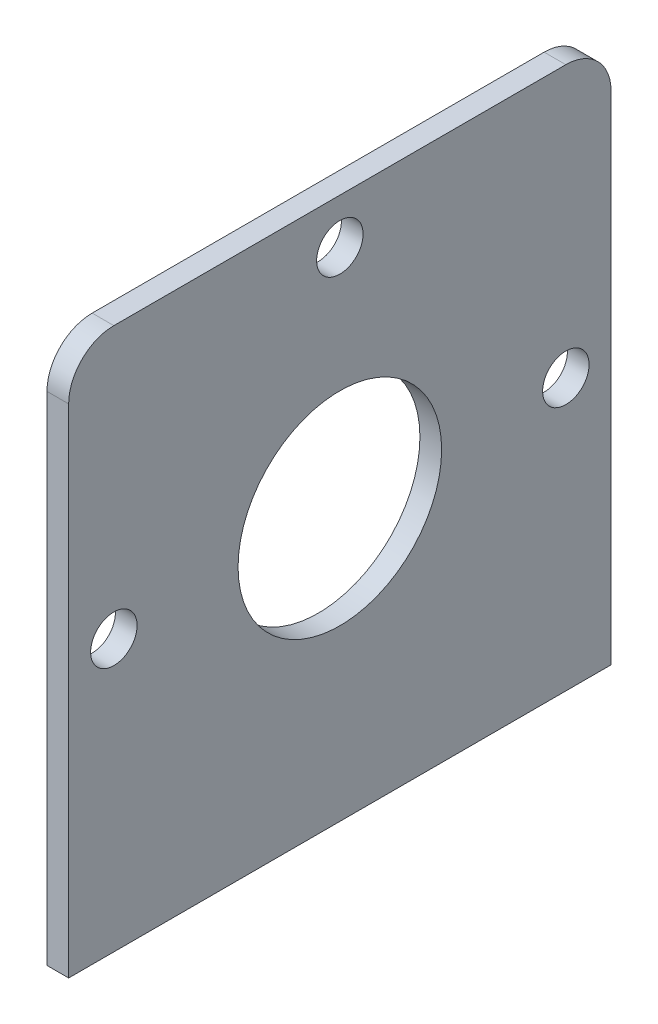
ISO-10303-21;
HEADER;
FILE_DESCRIPTION(('STEP AP214'),'2;1');
FILE_NAME('part.step','',(''),(''),'','','');
FILE_SCHEMA(('AUTOMOTIVE_DESIGN { 1 0 10303 214 1 1 1 1 }'));
ENDSEC;
DATA;
#1=APPLICATION_CONTEXT('core data for automotive mechanical design processes');
#2=APPLICATION_PROTOCOL_DEFINITION('international standard','automotive_design',2000,#1);
#3=PRODUCT_CONTEXT('',#1,'mechanical');
#4=PRODUCT('Part','Part','',(#3));
#5=PRODUCT_RELATED_PRODUCT_CATEGORY('part','',(#4));
#6=PRODUCT_DEFINITION_FORMATION('','',#4);
#7=PRODUCT_DEFINITION_CONTEXT('part definition',#1,'design');
#8=PRODUCT_DEFINITION('design','',#6,#7);
#9=PRODUCT_DEFINITION_SHAPE('','',#8);
#10=(LENGTH_UNIT() NAMED_UNIT(*) SI_UNIT(.MILLI.,.METRE.));
#11=(NAMED_UNIT(*) PLANE_ANGLE_UNIT() SI_UNIT($,.RADIAN.));
#12=(NAMED_UNIT(*) SI_UNIT($,.STERADIAN.) SOLID_ANGLE_UNIT());
#13=UNCERTAINTY_MEASURE_WITH_UNIT(LENGTH_MEASURE(1.E-05),#10,'distance_accuracy_value','');
#14=(GEOMETRIC_REPRESENTATION_CONTEXT(3) GLOBAL_UNCERTAINTY_ASSIGNED_CONTEXT((#13)) GLOBAL_UNIT_ASSIGNED_CONTEXT((#10,
#11,#12)) REPRESENTATION_CONTEXT('',''));
#15=CARTESIAN_POINT('',(0.,0.,0.));
#16=DIRECTION('',(0.,0.,1.));
#17=DIRECTION('',(1.,0.,0.));
#18=AXIS2_PLACEMENT_3D('',#15,#16,#17);
#19=CARTESIAN_POINT('',(1.524,0.,0.));
#20=DIRECTION('',(-1.,0.,0.));
#21=DIRECTION('',(0.,0.,1.));
#22=AXIS2_PLACEMENT_3D('',#19,#20,#21);
#23=PLANE('',#22);
#24=CARTESIAN_POINT('',(1.524,0.,15.875));
#25=DIRECTION('',(1.,0.,0.));
#26=DIRECTION('',(0.,0.,-1.));
#27=AXIS2_PLACEMENT_3D('',#24,#25,#26);
#28=CIRCLE('',#27,1.63195);
#29=CARTESIAN_POINT('',(1.524,0.,14.24305));
#30=VERTEX_POINT('',#29);
#31=EDGE_CURVE('E282',#30,#30,#28,.T.);
#32=ORIENTED_EDGE('',*,*,#31,.F.);
#33=EDGE_LOOP('',(#32));
#34=FACE_BOUND('',#33,.T.);
#35=DIRECTION('',(0.,1.,0.));
#36=VECTOR('',#35,1.);
#37=CARTESIAN_POINT('',(1.524,19.05,-19.05));
#38=LINE('',#37,#36);
#39=CARTESIAN_POINT('',(1.524,-19.05,-19.05));
#40=VERTEX_POINT('',#39);
#41=CARTESIAN_POINT('',(1.524,15.875,-19.05));
#42=VERTEX_POINT('',#41);
#43=EDGE_CURVE('E98',#40,#42,#38,.T.);
#44=ORIENTED_EDGE('',*,*,#43,.T.);
#45=CARTESIAN_POINT('',(1.524,15.875,-15.875));
#46=DIRECTION('',(-1.,0.,0.));
#47=DIRECTION('',(0.,0.,1.));
#48=AXIS2_PLACEMENT_3D('',#45,#46,#47);
#49=CIRCLE('',#48,3.175);
#50=CARTESIAN_POINT('',(1.524,19.05,-15.875));
#51=VERTEX_POINT('',#50);
#52=EDGE_CURVE('E53',#42,#51,#49,.F.);
#53=ORIENTED_EDGE('',*,*,#52,.T.);
#54=DIRECTION('',(0.,0.,1.));
#55=VECTOR('',#54,1.);
#56=CARTESIAN_POINT('',(1.524,19.05,19.05));
#57=LINE('',#56,#55);
#58=CARTESIAN_POINT('',(1.524,19.05,15.875));
#59=VERTEX_POINT('',#58);
#60=EDGE_CURVE('E106',#51,#59,#57,.T.);
#61=ORIENTED_EDGE('',*,*,#60,.T.);
#62=CARTESIAN_POINT('',(1.524,15.875,15.875));
#63=DIRECTION('',(-1.,0.,0.));
#64=DIRECTION('',(0.,0.,1.));
#65=AXIS2_PLACEMENT_3D('',#62,#63,#64);
#66=CIRCLE('',#65,3.175);
#67=CARTESIAN_POINT('',(1.524,15.875,19.05));
#68=VERTEX_POINT('',#67);
#69=EDGE_CURVE('E60',#59,#68,#66,.F.);
#70=ORIENTED_EDGE('',*,*,#69,.T.);
#71=DIRECTION('',(0.,-1.,0.));
#72=VECTOR('',#71,1.);
#73=CARTESIAN_POINT('',(1.524,-19.05,19.05));
#74=LINE('',#73,#72);
#75=CARTESIAN_POINT('',(1.524,-19.05,19.05));
#76=VERTEX_POINT('',#75);
#77=EDGE_CURVE('E111',#68,#76,#74,.T.);
#78=ORIENTED_EDGE('',*,*,#77,.T.);
#79=DIRECTION('',(0.,0.,-1.));
#80=VECTOR('',#79,1.);
#81=CARTESIAN_POINT('',(1.524,-19.05,-19.05));
#82=LINE('',#81,#80);
#83=EDGE_CURVE('E107',#76,#40,#82,.T.);
#84=ORIENTED_EDGE('',*,*,#83,.T.);
#85=EDGE_LOOP('',(#44,#53,#61,#70,#78,#84));
#86=FACE_BOUND('',#85,.T.);
#87=CARTESIAN_POINT('',(1.524,0.,0.));
#88=DIRECTION('',(1.,0.,0.));
#89=DIRECTION('',(0.,0.,-1.));
#90=AXIS2_PLACEMENT_3D('',#87,#88,#89);
#91=CIRCLE('',#90,7.1501);
#92=CARTESIAN_POINT('',(1.524,0.,-7.1501));
#93=VERTEX_POINT('',#92);
#94=EDGE_CURVE('E166',#93,#93,#91,.T.);
#95=ORIENTED_EDGE('',*,*,#94,.F.);
#96=EDGE_LOOP('',(#95));
#97=FACE_BOUND('',#96,.T.);
#98=CARTESIAN_POINT('',(1.524,15.875,0.));
#99=DIRECTION('',(1.,0.,0.));
#100=DIRECTION('',(0.,0.,-1.));
#101=AXIS2_PLACEMENT_3D('',#98,#99,#100);
#102=CIRCLE('',#101,1.63195);
#103=CARTESIAN_POINT('',(1.524,15.875,-1.63195));
#104=VERTEX_POINT('',#103);
#105=EDGE_CURVE('E299',#104,#104,#102,.T.);
#106=ORIENTED_EDGE('',*,*,#105,.F.);
#107=EDGE_LOOP('',(#106));
#108=FACE_BOUND('',#107,.T.);
#109=CARTESIAN_POINT('',(1.524,0.,-15.875));
#110=DIRECTION('',(1.,0.,0.));
#111=DIRECTION('',(0.,0.,-1.));
#112=AXIS2_PLACEMENT_3D('',#109,#110,#111);
#113=CIRCLE('',#112,1.63195);
#114=CARTESIAN_POINT('',(1.524,0.,-17.50695));
#115=VERTEX_POINT('',#114);
#116=EDGE_CURVE('E287',#115,#115,#113,.T.);
#117=ORIENTED_EDGE('',*,*,#116,.F.);
#118=EDGE_LOOP('',(#117));
#119=FACE_BOUND('',#118,.T.);
#120=ADVANCED_FACE('F44',(#34,#86,#97,#108,#119),#23,.F.);
#121=CARTESIAN_POINT('',(0.,0.,0.));
#122=DIRECTION('',(-1.,0.,0.));
#123=DIRECTION('',(0.,0.,1.));
#124=AXIS2_PLACEMENT_3D('',#121,#122,#123);
#125=PLANE('',#124);
#126=CARTESIAN_POINT('',(0.,0.,15.875));
#127=DIRECTION('',(-1.,0.,0.));
#128=DIRECTION('',(0.,0.,1.));
#129=AXIS2_PLACEMENT_3D('',#126,#127,#128);
#130=CIRCLE('',#129,1.63195);
#131=CARTESIAN_POINT('',(0.,0.,17.50695));
#132=VERTEX_POINT('',#131);
#133=EDGE_CURVE('E285',#132,#132,#130,.T.);
#134=ORIENTED_EDGE('',*,*,#133,.F.);
#135=EDGE_LOOP('',(#134));
#136=FACE_BOUND('',#135,.T.);
#137=CARTESIAN_POINT('',(0.,0.,-15.875));
#138=DIRECTION('',(-1.,0.,0.));
#139=DIRECTION('',(0.,0.,1.));
#140=AXIS2_PLACEMENT_3D('',#137,#138,#139);
#141=CIRCLE('',#140,1.63195);
#142=CARTESIAN_POINT('',(0.,0.,-14.24305));
#143=VERTEX_POINT('',#142);
#144=EDGE_CURVE('E292',#143,#143,#141,.T.);
#145=ORIENTED_EDGE('',*,*,#144,.F.);
#146=EDGE_LOOP('',(#145));
#147=FACE_BOUND('',#146,.T.);
#148=CARTESIAN_POINT('',(0.,15.875,0.));
#149=DIRECTION('',(-1.,0.,0.));
#150=DIRECTION('',(0.,0.,1.));
#151=AXIS2_PLACEMENT_3D('',#148,#149,#150);
#152=CIRCLE('',#151,1.63195);
#153=CARTESIAN_POINT('',(0.,15.875,1.63195));
#154=VERTEX_POINT('',#153);
#155=EDGE_CURVE('E303',#154,#154,#152,.T.);
#156=ORIENTED_EDGE('',*,*,#155,.F.);
#157=EDGE_LOOP('',(#156));
#158=FACE_BOUND('',#157,.T.);
#159=DIRECTION('',(0.,0.,1.));
#160=VECTOR('',#159,1.);
#161=CARTESIAN_POINT('',(0.,19.05,19.05));
#162=LINE('',#161,#160);
#163=CARTESIAN_POINT('',(0.,19.05,-15.875));
#164=VERTEX_POINT('',#163);
#165=CARTESIAN_POINT('',(0.,19.05,15.875));
#166=VERTEX_POINT('',#165);
#167=EDGE_CURVE('E160',#164,#166,#162,.T.);
#168=ORIENTED_EDGE('',*,*,#167,.F.);
#169=CARTESIAN_POINT('',(0.,15.875,-15.875));
#170=DIRECTION('',(-1.,0.,0.));
#171=DIRECTION('',(0.,0.,1.));
#172=AXIS2_PLACEMENT_3D('',#169,#170,#171);
#173=CIRCLE('',#172,3.175);
#174=CARTESIAN_POINT('',(0.,15.875,-19.05));
#175=VERTEX_POINT('',#174);
#176=EDGE_CURVE('E138',#164,#175,#173,.T.);
#177=ORIENTED_EDGE('',*,*,#176,.T.);
#178=DIRECTION('',(0.,1.,0.));
#179=VECTOR('',#178,1.);
#180=CARTESIAN_POINT('',(0.,19.05,-19.05));
#181=LINE('',#180,#179);
#182=CARTESIAN_POINT('',(0.,-19.05,-19.05));
#183=VERTEX_POINT('',#182);
#184=EDGE_CURVE('E159',#183,#175,#181,.T.);
#185=ORIENTED_EDGE('',*,*,#184,.F.);
#186=DIRECTION('',(0.,0.,-1.));
#187=VECTOR('',#186,1.);
#188=CARTESIAN_POINT('',(0.,-19.05,-19.05));
#189=LINE('',#188,#187);
#190=CARTESIAN_POINT('',(0.,-19.05,19.05));
#191=VERTEX_POINT('',#190);
#192=EDGE_CURVE('E120',#191,#183,#189,.T.);
#193=ORIENTED_EDGE('',*,*,#192,.F.);
#194=DIRECTION('',(0.,-1.,0.));
#195=VECTOR('',#194,1.);
#196=CARTESIAN_POINT('',(0.,-19.05,19.05));
#197=LINE('',#196,#195);
#198=CARTESIAN_POINT('',(0.,15.875,19.05));
#199=VERTEX_POINT('',#198);
#200=EDGE_CURVE('E116',#199,#191,#197,.T.);
#201=ORIENTED_EDGE('',*,*,#200,.F.);
#202=CARTESIAN_POINT('',(0.,15.875,15.875));
#203=DIRECTION('',(-1.,0.,0.));
#204=DIRECTION('',(0.,0.,1.));
#205=AXIS2_PLACEMENT_3D('',#202,#203,#204);
#206=CIRCLE('',#205,3.175);
#207=EDGE_CURVE('E135',#199,#166,#206,.T.);
#208=ORIENTED_EDGE('',*,*,#207,.T.);
#209=EDGE_LOOP('',(#168,#177,#185,#193,#201,#208));
#210=FACE_BOUND('',#209,.T.);
#211=CARTESIAN_POINT('',(0.,0.,0.));
#212=DIRECTION('',(1.,0.,0.));
#213=DIRECTION('',(0.,0.,-1.));
#214=AXIS2_PLACEMENT_3D('',#211,#212,#213);
#215=CIRCLE('',#214,7.1501);
#216=CARTESIAN_POINT('',(0.,0.,-7.1501));
#217=VERTEX_POINT('',#216);
#218=EDGE_CURVE('E307',#217,#217,#215,.T.);
#219=ORIENTED_EDGE('',*,*,#218,.T.);
#220=EDGE_LOOP('',(#219));
#221=FACE_BOUND('',#220,.T.);
#222=ADVANCED_FACE('F157',(#136,#147,#158,#210,#221),#125,.T.);
#223=CARTESIAN_POINT('',(1.524,-19.05,-19.05));
#224=DIRECTION('',(0.,1.,0.));
#225=DIRECTION('',(0.,0.,1.));
#226=AXIS2_PLACEMENT_3D('',#223,#224,#225);
#227=PLANE('',#226);
#228=ORIENTED_EDGE('',*,*,#192,.T.);
#229=DIRECTION('',(-1.,0.,0.));
#230=VECTOR('',#229,1.);
#231=CARTESIAN_POINT('',(1.524,-19.05,-19.05));
#232=LINE('',#231,#230);
#233=EDGE_CURVE('E102',#40,#183,#232,.T.);
#234=ORIENTED_EDGE('',*,*,#233,.F.);
#235=ORIENTED_EDGE('',*,*,#83,.F.);
#236=DIRECTION('',(-1.,0.,0.));
#237=VECTOR('',#236,1.);
#238=CARTESIAN_POINT('',(1.524,-19.05,19.05));
#239=LINE('',#238,#237);
#240=EDGE_CURVE('E123',#76,#191,#239,.T.);
#241=ORIENTED_EDGE('',*,*,#240,.T.);
#242=EDGE_LOOP('',(#228,#234,#235,#241));
#243=FACE_BOUND('',#242,.T.);
#244=ADVANCED_FACE('F118',(#243),#227,.F.);
#245=CARTESIAN_POINT('',(1.524,19.05,-19.05));
#246=DIRECTION('',(0.,0.,1.));
#247=DIRECTION('',(0.,-1.,0.));
#248=AXIS2_PLACEMENT_3D('',#245,#246,#247);
#249=PLANE('',#248);
#250=ORIENTED_EDGE('',*,*,#184,.T.);
#251=DIRECTION('',(-1.,0.,0.));
#252=VECTOR('',#251,1.);
#253=CARTESIAN_POINT('',(1.524,15.875,-19.05));
#254=LINE('',#253,#252);
#255=EDGE_CURVE('E68',#175,#42,#254,.F.);
#256=ORIENTED_EDGE('',*,*,#255,.T.);
#257=ORIENTED_EDGE('',*,*,#43,.F.);
#258=ORIENTED_EDGE('',*,*,#233,.T.);
#259=EDGE_LOOP('',(#250,#256,#257,#258));
#260=FACE_BOUND('',#259,.T.);
#261=ADVANCED_FACE('F100',(#260),#249,.F.);
#262=CARTESIAN_POINT('',(1.524,19.05,19.05));
#263=DIRECTION('',(0.,-1.,0.));
#264=DIRECTION('',(0.,0.,-1.));
#265=AXIS2_PLACEMENT_3D('',#262,#263,#264);
#266=PLANE('',#265);
#267=ORIENTED_EDGE('',*,*,#60,.F.);
#268=DIRECTION('',(-1.,0.,0.));
#269=VECTOR('',#268,1.);
#270=CARTESIAN_POINT('',(1.524,19.05,-15.875));
#271=LINE('',#270,#269);
#272=EDGE_CURVE('E127',#51,#164,#271,.T.);
#273=ORIENTED_EDGE('',*,*,#272,.T.);
#274=ORIENTED_EDGE('',*,*,#167,.T.);
#275=DIRECTION('',(-1.,0.,0.));
#276=VECTOR('',#275,1.);
#277=CARTESIAN_POINT('',(1.524,19.05,15.875));
#278=LINE('',#277,#276);
#279=EDGE_CURVE('E122',#166,#59,#278,.F.);
#280=ORIENTED_EDGE('',*,*,#279,.T.);
#281=EDGE_LOOP('',(#267,#273,#274,#280));
#282=FACE_BOUND('',#281,.T.);
#283=ADVANCED_FACE('F149',(#282),#266,.F.);
#284=CARTESIAN_POINT('',(1.524,-19.05,19.05));
#285=DIRECTION('',(0.,0.,-1.));
#286=DIRECTION('',(-1.,0.,0.));
#287=AXIS2_PLACEMENT_3D('',#284,#285,#286);
#288=PLANE('',#287);
#289=ORIENTED_EDGE('',*,*,#77,.F.);
#290=DIRECTION('',(-1.,0.,0.));
#291=VECTOR('',#290,1.);
#292=CARTESIAN_POINT('',(1.524,15.875,19.05));
#293=LINE('',#292,#291);
#294=EDGE_CURVE('E11',#68,#199,#293,.T.);
#295=ORIENTED_EDGE('',*,*,#294,.T.);
#296=ORIENTED_EDGE('',*,*,#200,.T.);
#297=ORIENTED_EDGE('',*,*,#240,.F.);
#298=EDGE_LOOP('',(#289,#295,#296,#297));
#299=FACE_BOUND('',#298,.T.);
#300=ADVANCED_FACE('F172',(#299),#288,.F.);
#301=CARTESIAN_POINT('',(1.524,0.,0.));
#302=DIRECTION('',(-1.,0.,0.));
#303=DIRECTION('',(0.,0.,1.));
#304=AXIS2_PLACEMENT_3D('',#301,#302,#303);
#305=CYLINDRICAL_SURFACE('',#304,7.1501);
#306=ORIENTED_EDGE('',*,*,#94,.T.);
#307=EDGE_LOOP('',(#306));
#308=FACE_BOUND('',#307,.T.);
#309=ORIENTED_EDGE('',*,*,#218,.F.);
#310=EDGE_LOOP('',(#309));
#311=FACE_BOUND('',#310,.T.);
#312=ADVANCED_FACE('F191',(#308,#311),#305,.F.);
#313=CARTESIAN_POINT('',(1.524,15.875,0.));
#314=DIRECTION('',(1.,0.,0.));
#315=DIRECTION('',(0.,0.,-1.));
#316=AXIS2_PLACEMENT_3D('',#313,#314,#315);
#317=CYLINDRICAL_SURFACE('',#316,1.63195);
#318=ORIENTED_EDGE('',*,*,#105,.T.);
#319=EDGE_LOOP('',(#318));
#320=FACE_BOUND('',#319,.T.);
#321=ORIENTED_EDGE('',*,*,#155,.T.);
#322=EDGE_LOOP('',(#321));
#323=FACE_BOUND('',#322,.T.);
#324=ADVANCED_FACE('F212',(#320,#323),#317,.F.);
#325=CARTESIAN_POINT('',(1.524,0.,-15.875));
#326=DIRECTION('',(1.,0.,0.));
#327=DIRECTION('',(0.,0.,-1.));
#328=AXIS2_PLACEMENT_3D('',#325,#326,#327);
#329=CYLINDRICAL_SURFACE('',#328,1.63195);
#330=ORIENTED_EDGE('',*,*,#116,.T.);
#331=EDGE_LOOP('',(#330));
#332=FACE_BOUND('',#331,.T.);
#333=ORIENTED_EDGE('',*,*,#144,.T.);
#334=EDGE_LOOP('',(#333));
#335=FACE_BOUND('',#334,.T.);
#336=ADVANCED_FACE('F221',(#332,#335),#329,.F.);
#337=CARTESIAN_POINT('',(1.524,0.,15.875));
#338=DIRECTION('',(1.,0.,0.));
#339=DIRECTION('',(0.,0.,-1.));
#340=AXIS2_PLACEMENT_3D('',#337,#338,#339);
#341=CYLINDRICAL_SURFACE('',#340,1.63195);
#342=ORIENTED_EDGE('',*,*,#31,.T.);
#343=EDGE_LOOP('',(#342));
#344=FACE_BOUND('',#343,.T.);
#345=ORIENTED_EDGE('',*,*,#133,.T.);
#346=EDGE_LOOP('',(#345));
#347=FACE_BOUND('',#346,.T.);
#348=ADVANCED_FACE('F179',(#344,#347),#341,.F.);
#349=CARTESIAN_POINT('',(1.524,15.875,-15.875));
#350=DIRECTION('',(-1.,0.,0.));
#351=DIRECTION('',(0.,0.,1.));
#352=AXIS2_PLACEMENT_3D('',#349,#350,#351);
#353=CYLINDRICAL_SURFACE('',#352,3.175);
#354=ORIENTED_EDGE('',*,*,#52,.F.);
#355=ORIENTED_EDGE('',*,*,#255,.F.);
#356=ORIENTED_EDGE('',*,*,#176,.F.);
#357=ORIENTED_EDGE('',*,*,#272,.F.);
#358=EDGE_LOOP('',(#354,#355,#356,#357));
#359=FACE_BOUND('',#358,.T.);
#360=ADVANCED_FACE('F155',(#359),#353,.T.);
#361=CARTESIAN_POINT('',(1.524,15.875,15.875));
#362=DIRECTION('',(-1.,0.,0.));
#363=DIRECTION('',(0.,0.,1.));
#364=AXIS2_PLACEMENT_3D('',#361,#362,#363);
#365=CYLINDRICAL_SURFACE('',#364,3.175);
#366=ORIENTED_EDGE('',*,*,#69,.F.);
#367=ORIENTED_EDGE('',*,*,#279,.F.);
#368=ORIENTED_EDGE('',*,*,#207,.F.);
#369=ORIENTED_EDGE('',*,*,#294,.F.);
#370=EDGE_LOOP('',(#366,#367,#368,#369));
#371=FACE_BOUND('',#370,.T.);
#372=ADVANCED_FACE('F46',(#371),#365,.T.);
#373=CLOSED_SHELL('',(#120,#222,#244,#261,#283,#300,#312,#324,#336,#348,#360,#372));
#374=MANIFOLD_SOLID_BREP('B2',#373);
#375=ADVANCED_BREP_SHAPE_REPRESENTATION('',(#18,#374),#14);
#376=SHAPE_DEFINITION_REPRESENTATION(#9,#375);
ENDSEC;
END-ISO-10303-21;
